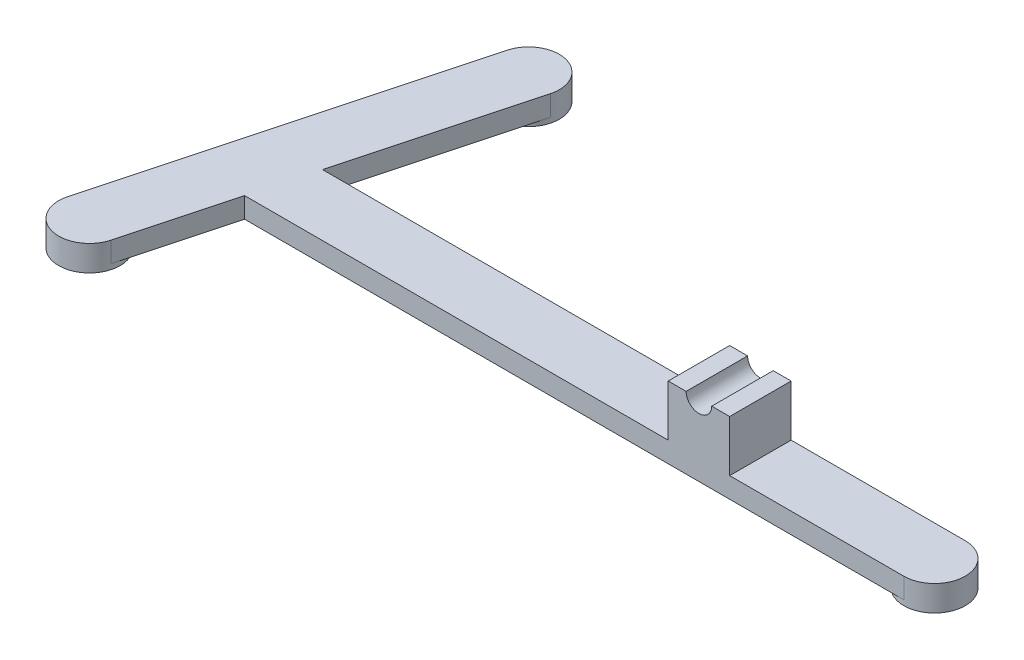
ISO-10303-21;
HEADER;
FILE_DESCRIPTION(('STEP AP214'),'2;1');
FILE_NAME('part.step','',(''),(''),'','','');
FILE_SCHEMA(('AUTOMOTIVE_DESIGN { 1 0 10303 214 1 1 1 1 }'));
ENDSEC;
DATA;
#1=APPLICATION_CONTEXT('core data for automotive mechanical design processes');
#2=APPLICATION_PROTOCOL_DEFINITION('international standard','automotive_design',2000,#1);
#3=PRODUCT_CONTEXT('',#1,'mechanical');
#4=PRODUCT('Part','Part','',(#3));
#5=PRODUCT_RELATED_PRODUCT_CATEGORY('part','',(#4));
#6=PRODUCT_DEFINITION_FORMATION('','',#4);
#7=PRODUCT_DEFINITION_CONTEXT('part definition',#1,'design');
#8=PRODUCT_DEFINITION('design','',#6,#7);
#9=PRODUCT_DEFINITION_SHAPE('','',#8);
#10=(LENGTH_UNIT() NAMED_UNIT(*) SI_UNIT(.MILLI.,.METRE.));
#11=(NAMED_UNIT(*) PLANE_ANGLE_UNIT() SI_UNIT($,.RADIAN.));
#12=(NAMED_UNIT(*) SI_UNIT($,.STERADIAN.) SOLID_ANGLE_UNIT());
#13=UNCERTAINTY_MEASURE_WITH_UNIT(LENGTH_MEASURE(1.E-05),#10,'distance_accuracy_value','');
#14=(GEOMETRIC_REPRESENTATION_CONTEXT(3) GLOBAL_UNCERTAINTY_ASSIGNED_CONTEXT((#13)) GLOBAL_UNIT_ASSIGNED_CONTEXT((#10,
#11,#12)) REPRESENTATION_CONTEXT('',''));
#15=CARTESIAN_POINT('',(0.,0.,0.));
#16=DIRECTION('',(0.,0.,1.));
#17=DIRECTION('',(1.,0.,0.));
#18=AXIS2_PLACEMENT_3D('',#15,#16,#17);
#19=CARTESIAN_POINT('',(0.,14.,0.));
#20=DIRECTION('',(0.,1.,0.));
#21=DIRECTION('',(0.,0.,1.));
#22=AXIS2_PLACEMENT_3D('',#19,#20,#21);
#23=PLANE('',#22);
#24=DIRECTION('',(0.,0.,1.));
#25=VECTOR('',#24,1.);
#26=CARTESIAN_POINT('',(96.6195321634862,14.,-17.4385911735114));
#27=LINE('',#26,#25);
#28=CARTESIAN_POINT('',(96.6195321634862,14.,-15.4385911735114));
#29=VERTEX_POINT('',#28);
#30=CARTESIAN_POINT('',(96.6195321634862,14.,-3.43859117351141));
#31=VERTEX_POINT('',#30);
#32=EDGE_CURVE('E11',#29,#31,#27,.T.);
#33=ORIENTED_EDGE('',*,*,#32,.F.);
#34=DIRECTION('',(1.,0.,0.));
#35=VECTOR('',#34,1.);
#36=CARTESIAN_POINT('',(0.,14.,-15.4385911735114));
#37=LINE('',#36,#35);
#38=CARTESIAN_POINT('',(93.1195321634862,14.,-15.4385911735114));
#39=VERTEX_POINT('',#38);
#40=EDGE_CURVE('E164',#39,#29,#37,.T.);
#41=ORIENTED_EDGE('',*,*,#40,.F.);
#42=DIRECTION('',(0.,0.,-1.));
#43=VECTOR('',#42,1.);
#44=CARTESIAN_POINT('',(93.1195321634862,14.,0.));
#45=LINE('',#44,#43);
#46=CARTESIAN_POINT('',(93.1195321634862,14.,-3.43859117351141));
#47=VERTEX_POINT('',#46);
#48=EDGE_CURVE('E154',#47,#39,#45,.T.);
#49=ORIENTED_EDGE('',*,*,#48,.F.);
#50=DIRECTION('',(1.,0.,0.));
#51=VECTOR('',#50,1.);
#52=CARTESIAN_POINT('',(0.,14.,-3.43859117351141));
#53=LINE('',#52,#51);
#54=EDGE_CURVE('E148',#47,#31,#53,.T.);
#55=ORIENTED_EDGE('',*,*,#54,.T.);
#56=EDGE_LOOP('',(#33,#41,#49,#55));
#57=FACE_BOUND('',#56,.T.);
#58=ADVANCED_FACE('F36',(#57),#23,.T.);
#59=CARTESIAN_POINT('',(0.,4.,-15.4385911735114));
#60=DIRECTION('',(0.,0.,-1.));
#61=DIRECTION('',(-1.,0.,0.));
#62=AXIS2_PLACEMENT_3D('',#59,#60,#61);
#63=PLANE('',#62);
#64=CARTESIAN_POINT('',(99.1195321634862,14.,-15.4385911735114));
#65=DIRECTION('',(0.,0.,-1.));
#66=DIRECTION('',(-1.,0.,0.));
#67=AXIS2_PLACEMENT_3D('',#64,#65,#66);
#68=CIRCLE('',#67,2.5);
#69=CARTESIAN_POINT('',(101.619532163486,14.,-15.4385911735114));
#70=VERTEX_POINT('',#69);
#71=EDGE_CURVE('E138',#70,#29,#68,.T.);
#72=ORIENTED_EDGE('',*,*,#71,.F.);
#73=CARTESIAN_POINT('',(105.119532163486,14.,-15.4385911735114));
#74=VERTEX_POINT('',#73);
#75=EDGE_CURVE('E158',#70,#74,#37,.T.);
#76=ORIENTED_EDGE('',*,*,#75,.T.);
#77=DIRECTION('',(0.,-1.,0.));
#78=VECTOR('',#77,1.);
#79=CARTESIAN_POINT('',(105.119532163486,14.,-15.4385911735114));
#80=LINE('',#79,#78);
#81=CARTESIAN_POINT('',(105.119532163486,4.,-15.4385911735114));
#82=VERTEX_POINT('',#81);
#83=EDGE_CURVE('E171',#74,#82,#80,.T.);
#84=ORIENTED_EDGE('',*,*,#83,.T.);
#85=DIRECTION('',(1.,0.,0.));
#86=VECTOR('',#85,1.);
#87=CARTESIAN_POINT('',(0.,4.,-15.4385911735114));
#88=LINE('',#87,#86);
#89=CARTESIAN_POINT('',(139.119532163486,4.,-15.4385911735114));
#90=VERTEX_POINT('',#89);
#91=EDGE_CURVE('E58',#82,#90,#88,.T.);
#92=ORIENTED_EDGE('',*,*,#91,.T.);
#93=DIRECTION('',(0.,-1.,0.));
#94=VECTOR('',#93,1.);
#95=CARTESIAN_POINT('',(139.119532163486,4.,-15.4385911735114));
#96=LINE('',#95,#94);
#97=CARTESIAN_POINT('',(139.119532163486,0.,-15.4385911735114));
#98=VERTEX_POINT('',#97);
#99=EDGE_CURVE('E160',#90,#98,#96,.T.);
#100=ORIENTED_EDGE('',*,*,#99,.T.);
#101=DIRECTION('',(1.,0.,0.));
#102=VECTOR('',#101,1.);
#103=CARTESIAN_POINT('',(0.,0.,-15.4385911735114));
#104=LINE('',#103,#102);
#105=CARTESIAN_POINT('',(13.6376142113114,0.,-15.4385911735114));
#106=VERTEX_POINT('',#105);
#107=EDGE_CURVE('E189',#106,#98,#104,.T.);
#108=ORIENTED_EDGE('',*,*,#107,.F.);
#109=DIRECTION('',(0.,-1.,0.));
#110=VECTOR('',#109,1.);
#111=CARTESIAN_POINT('',(13.6376142113114,4.,-15.4385911735114));
#112=LINE('',#111,#110);
#113=CARTESIAN_POINT('',(13.6376142113114,4.,-15.4385911735114));
#114=VERTEX_POINT('',#113);
#115=EDGE_CURVE('E237',#114,#106,#112,.T.);
#116=ORIENTED_EDGE('',*,*,#115,.F.);
#117=DIRECTION('',(1.,0.,0.));
#118=VECTOR('',#117,1.);
#119=CARTESIAN_POINT('',(0.,4.,-15.4385911735114));
#120=LINE('',#119,#118);
#121=CARTESIAN_POINT('',(93.1195321634862,4.,-15.4385911735114));
#122=VERTEX_POINT('',#121);
#123=EDGE_CURVE('E190',#114,#122,#120,.T.);
#124=ORIENTED_EDGE('',*,*,#123,.T.);
#125=DIRECTION('',(0.,-1.,0.));
#126=VECTOR('',#125,1.);
#127=CARTESIAN_POINT('',(93.1195321634862,14.,-15.4385911735114));
#128=LINE('',#127,#126);
#129=EDGE_CURVE('E169',#39,#122,#128,.T.);
#130=ORIENTED_EDGE('',*,*,#129,.F.);
#131=ORIENTED_EDGE('',*,*,#40,.T.);
#132=EDGE_LOOP('',(#72,#76,#84,#92,#100,#108,#116,#124,#130,#131));
#133=FACE_BOUND('',#132,.T.);
#134=ADVANCED_FACE('F38',(#133),#63,.T.);
#135=CARTESIAN_POINT('',(8.86441948928159,4.,2.37521404352368));
#136=DIRECTION('',(-0.965925826289069,0.,-0.258819045102518));
#137=DIRECTION('',(-0.258819045102518,0.,0.965925826289069));
#138=AXIS2_PLACEMENT_3D('',#135,#136,#137);
#139=PLANE('',#138);
#140=DIRECTION('',(0.258819045102518,0.,-0.965925826289069));
#141=VECTOR('',#140,1.);
#142=CARTESIAN_POINT('',(8.86441948928159,0.,2.37521404352368));
#143=LINE('',#142,#141);
#144=CARTESIAN_POINT('',(23.0324202783969,0.,-50.5004847431312));
#145=VERTEX_POINT('',#144);
#146=EDGE_CURVE('E210',#106,#145,#143,.T.);
#147=ORIENTED_EDGE('',*,*,#146,.T.);
#148=DIRECTION('',(0.,-1.,0.));
#149=VECTOR('',#148,1.);
#150=CARTESIAN_POINT('',(23.0324202783969,4.,-50.5004847431312));
#151=LINE('',#150,#149);
#152=CARTESIAN_POINT('',(23.0324202783969,4.,-50.5004847431312));
#153=VERTEX_POINT('',#152);
#154=EDGE_CURVE('E235',#153,#145,#151,.T.);
#155=ORIENTED_EDGE('',*,*,#154,.F.);
#156=DIRECTION('',(0.258819045102518,0.,-0.965925826289069));
#157=VECTOR('',#156,1.);
#158=CARTESIAN_POINT('',(8.86441948928159,4.,2.37521404352368));
#159=LINE('',#158,#157);
#160=EDGE_CURVE('E193',#114,#153,#159,.T.);
#161=ORIENTED_EDGE('',*,*,#160,.F.);
#162=ORIENTED_EDGE('',*,*,#115,.T.);
#163=EDGE_LOOP('',(#147,#155,#161,#162));
#164=FACE_BOUND('',#163,.T.);
#165=ADVANCED_FACE('F278',(#164),#139,.F.);
#166=CARTESIAN_POINT('',(-2.72669042618725,4.,-0.730614497706537));
#167=DIRECTION('',(-0.965925826289069,0.,-0.258819045102518));
#168=DIRECTION('',(-0.258819045102518,0.,0.965925826289069));
#169=AXIS2_PLACEMENT_3D('',#166,#167,#168);
#170=PLANE('',#169);
#171=DIRECTION('',(0.258819045102518,0.,-0.965925826289069));
#172=VECTOR('',#171,1.);
#173=CARTESIAN_POINT('',(-2.72669042618725,0.,-0.730614497706537));
#174=LINE('',#173,#172);
#175=CARTESIAN_POINT('',(-6.67602279424821,0.,14.0084945558735));
#176=VERTEX_POINT('',#175);
#177=CARTESIAN_POINT('',(11.441310362928,0.,-53.6063132843614));
#178=VERTEX_POINT('',#177);
#179=EDGE_CURVE('E216',#176,#178,#174,.T.);
#180=ORIENTED_EDGE('',*,*,#179,.F.);
#181=DIRECTION('',(0.,-1.,0.));
#182=VECTOR('',#181,1.);
#183=CARTESIAN_POINT('',(-6.67602279424821,4.,14.0084945558735));
#184=LINE('',#183,#182);
#185=CARTESIAN_POINT('',(-6.67602279424821,4.,14.0084945558735));
#186=VERTEX_POINT('',#185);
#187=EDGE_CURVE('E230',#186,#176,#184,.T.);
#188=ORIENTED_EDGE('',*,*,#187,.F.);
#189=DIRECTION('',(0.258819045102518,0.,-0.965925826289069));
#190=VECTOR('',#189,1.);
#191=CARTESIAN_POINT('',(-2.72669042618725,4.,-0.730614497706537));
#192=LINE('',#191,#190);
#193=CARTESIAN_POINT('',(11.441310362928,4.,-53.6063132843614));
#194=VERTEX_POINT('',#193);
#195=EDGE_CURVE('E197',#186,#194,#192,.T.);
#196=ORIENTED_EDGE('',*,*,#195,.T.);
#197=DIRECTION('',(0.,-1.,0.));
#198=VECTOR('',#197,1.);
#199=CARTESIAN_POINT('',(11.441310362928,4.,-53.6063132843614));
#200=LINE('',#199,#198);
#201=EDGE_CURVE('E232',#194,#178,#200,.T.);
#202=ORIENTED_EDGE('',*,*,#201,.T.);
#203=EDGE_LOOP('',(#180,#188,#196,#202));
#204=FACE_BOUND('',#203,.T.);
#205=ADVANCED_FACE('F294',(#204),#170,.T.);
#206=CARTESIAN_POINT('',(8.86441948928159,4.,2.37521404352368));
#207=DIRECTION('',(-0.965925826289069,0.,-0.258819045102518));
#208=DIRECTION('',(-0.258819045102518,0.,0.965925826289069));
#209=AXIS2_PLACEMENT_3D('',#206,#207,#208);
#210=PLANE('',#209);
#211=DIRECTION('',(0.258819045102518,0.,-0.965925826289069));
#212=VECTOR('',#211,1.);
#213=CARTESIAN_POINT('',(8.86441948928159,0.,2.37521404352368));
#214=LINE('',#213,#212);
#215=CARTESIAN_POINT('',(4.91508712122063,0.,17.1143230971037));
#216=VERTEX_POINT('',#215);
#217=CARTESIAN_POINT('',(10.422223902138,0.,-3.43859117351141));
#218=VERTEX_POINT('',#217);
#219=EDGE_CURVE('E222',#216,#218,#214,.T.);
#220=ORIENTED_EDGE('',*,*,#219,.T.);
#221=DIRECTION('',(0.,-1.,0.));
#222=VECTOR('',#221,1.);
#223=CARTESIAN_POINT('',(10.422223902138,4.,-3.43859117351141));
#224=LINE('',#223,#222);
#225=CARTESIAN_POINT('',(10.422223902138,4.,-3.43859117351141));
#226=VERTEX_POINT('',#225);
#227=EDGE_CURVE('E208',#226,#218,#224,.T.);
#228=ORIENTED_EDGE('',*,*,#227,.F.);
#229=DIRECTION('',(0.258819045102518,0.,-0.965925826289069));
#230=VECTOR('',#229,1.);
#231=CARTESIAN_POINT('',(8.86441948928159,4.,2.37521404352368));
#232=LINE('',#231,#230);
#233=CARTESIAN_POINT('',(4.91508712122062,4.,17.1143230971037));
#234=VERTEX_POINT('',#233);
#235=EDGE_CURVE('E200',#234,#226,#232,.T.);
#236=ORIENTED_EDGE('',*,*,#235,.F.);
#237=DIRECTION('',(0.,-1.,0.));
#238=VECTOR('',#237,1.);
#239=CARTESIAN_POINT('',(4.91508712122063,4.,17.1143230971037));
#240=LINE('',#239,#238);
#241=EDGE_CURVE('E227',#234,#216,#240,.T.);
#242=ORIENTED_EDGE('',*,*,#241,.T.);
#243=EDGE_LOOP('',(#220,#228,#236,#242));
#244=FACE_BOUND('',#243,.T.);
#245=ADVANCED_FACE('F287',(#244),#210,.F.);
#246=CARTESIAN_POINT('',(0.,4.,-3.43859117351141));
#247=DIRECTION('',(0.,0.,-1.));
#248=DIRECTION('',(-1.,0.,0.));
#249=AXIS2_PLACEMENT_3D('',#246,#247,#248);
#250=PLANE('',#249);
#251=CARTESIAN_POINT('',(101.619532163486,14.,-3.43859117351141));
#252=VERTEX_POINT('',#251);
#253=CARTESIAN_POINT('',(105.119532163486,14.,-3.43859117351141));
#254=VERTEX_POINT('',#253);
#255=EDGE_CURVE('E151',#252,#254,#53,.T.);
#256=ORIENTED_EDGE('',*,*,#255,.F.);
#257=CARTESIAN_POINT('',(99.1195321634862,14.,-3.43859117351141));
#258=DIRECTION('',(0.,0.,1.));
#259=DIRECTION('',(1.,0.,0.));
#260=AXIS2_PLACEMENT_3D('',#257,#258,#259);
#261=CIRCLE('',#260,2.5);
#262=EDGE_CURVE('E50',#31,#252,#261,.T.);
#263=ORIENTED_EDGE('',*,*,#262,.F.);
#264=ORIENTED_EDGE('',*,*,#54,.F.);
#265=DIRECTION('',(0.,-1.,0.));
#266=VECTOR('',#265,1.);
#267=CARTESIAN_POINT('',(93.1195321634862,14.,-3.43859117351141));
#268=LINE('',#267,#266);
#269=CARTESIAN_POINT('',(93.1195321634862,4.,-3.43859117351141));
#270=VERTEX_POINT('',#269);
#271=EDGE_CURVE('E167',#47,#270,#268,.T.);
#272=ORIENTED_EDGE('',*,*,#271,.T.);
#273=DIRECTION('',(1.,0.,0.));
#274=VECTOR('',#273,1.);
#275=CARTESIAN_POINT('',(0.,4.,-3.43859117351141));
#276=LINE('',#275,#274);
#277=EDGE_CURVE('E202',#226,#270,#276,.T.);
#278=ORIENTED_EDGE('',*,*,#277,.F.);
#279=ORIENTED_EDGE('',*,*,#227,.T.);
#280=DIRECTION('',(1.,0.,0.));
#281=VECTOR('',#280,1.);
#282=CARTESIAN_POINT('',(0.,0.,-3.43859117351141));
#283=LINE('',#282,#281);
#284=CARTESIAN_POINT('',(139.119532163486,0.,-3.43859117351141));
#285=VERTEX_POINT('',#284);
#286=EDGE_CURVE('E194',#218,#285,#283,.T.);
#287=ORIENTED_EDGE('',*,*,#286,.T.);
#288=DIRECTION('',(0.,-1.,0.));
#289=VECTOR('',#288,1.);
#290=CARTESIAN_POINT('',(139.119532163486,4.,-3.43859117351141));
#291=LINE('',#290,#289);
#292=CARTESIAN_POINT('',(139.119532163486,4.,-3.43859117351141));
#293=VERTEX_POINT('',#292);
#294=EDGE_CURVE('E262',#293,#285,#291,.T.);
#295=ORIENTED_EDGE('',*,*,#294,.F.);
#296=DIRECTION('',(1.,0.,0.));
#297=VECTOR('',#296,1.);
#298=CARTESIAN_POINT('',(0.,4.,-3.43859117351141));
#299=LINE('',#298,#297);
#300=CARTESIAN_POINT('',(105.119532163486,4.,-3.43859117351141));
#301=VERTEX_POINT('',#300);
#302=EDGE_CURVE('E253',#301,#293,#299,.T.);
#303=ORIENTED_EDGE('',*,*,#302,.F.);
#304=DIRECTION('',(0.,-1.,0.));
#305=VECTOR('',#304,1.);
#306=CARTESIAN_POINT('',(105.119532163486,14.,-3.43859117351141));
#307=LINE('',#306,#305);
#308=EDGE_CURVE('E174',#254,#301,#307,.T.);
#309=ORIENTED_EDGE('',*,*,#308,.F.);
#310=EDGE_LOOP('',(#256,#263,#264,#272,#278,#279,#287,#295,#303,#309));
#311=FACE_BOUND('',#310,.T.);
#312=ADVANCED_FACE('F146',(#311),#250,.F.);
#313=CARTESIAN_POINT('',(0.,4.,0.));
#314=DIRECTION('',(0.,1.,0.));
#315=DIRECTION('',(0.,0.,1.));
#316=AXIS2_PLACEMENT_3D('',#313,#314,#315);
#317=PLANE('',#316);
#318=ORIENTED_EDGE('',*,*,#123,.F.);
#319=ORIENTED_EDGE('',*,*,#160,.T.);
#320=CARTESIAN_POINT('',(17.2368653206625,4.,-52.0533990137463));
#321=DIRECTION('',(0.,1.,0.));
#322=DIRECTION('',(0.,0.,1.));
#323=AXIS2_PLACEMENT_3D('',#320,#321,#322);
#324=CIRCLE('',#323,6.);
#325=EDGE_CURVE('E177',#153,#194,#324,.T.);
#326=ORIENTED_EDGE('',*,*,#325,.T.);
#327=ORIENTED_EDGE('',*,*,#195,.F.);
#328=CARTESIAN_POINT('',(-0.880467836513796,4.,15.5614088264886));
#329=DIRECTION('',(0.,1.,0.));
#330=DIRECTION('',(0.,0.,1.));
#331=AXIS2_PLACEMENT_3D('',#328,#329,#330);
#332=CIRCLE('',#331,6.);
#333=EDGE_CURVE('E183',#186,#234,#332,.T.);
#334=ORIENTED_EDGE('',*,*,#333,.T.);
#335=ORIENTED_EDGE('',*,*,#235,.T.);
#336=ORIENTED_EDGE('',*,*,#277,.T.);
#337=DIRECTION('',(0.,0.,-1.));
#338=VECTOR('',#337,1.);
#339=CARTESIAN_POINT('',(93.1195321634862,4.,0.));
#340=LINE('',#339,#338);
#341=EDGE_CURVE('E205',#270,#122,#340,.T.);
#342=ORIENTED_EDGE('',*,*,#341,.T.);
#343=EDGE_LOOP('',(#318,#319,#326,#327,#334,#335,#336,#342));
#344=FACE_BOUND('',#343,.T.);
#345=ADVANCED_FACE('F280',(#344),#317,.T.);
#346=CARTESIAN_POINT('',(0.,0.,0.));
#347=DIRECTION('',(0.,1.,0.));
#348=DIRECTION('',(0.,0.,1.));
#349=AXIS2_PLACEMENT_3D('',#346,#347,#348);
#350=PLANE('',#349);
#351=ORIENTED_EDGE('',*,*,#107,.T.);
#352=CARTESIAN_POINT('',(139.119532163486,0.,-9.43859117351141));
#353=DIRECTION('',(0.,1.,0.));
#354=DIRECTION('',(0.,0.,1.));
#355=AXIS2_PLACEMENT_3D('',#352,#353,#354);
#356=CIRCLE('',#355,6.00000000000002);
#357=EDGE_CURVE('E251',#98,#285,#356,.T.);
#358=ORIENTED_EDGE('',*,*,#357,.T.);
#359=ORIENTED_EDGE('',*,*,#286,.F.);
#360=ORIENTED_EDGE('',*,*,#219,.F.);
#361=CARTESIAN_POINT('',(-0.880467836513796,0.,15.5614088264886));
#362=DIRECTION('',(0.,1.,0.));
#363=DIRECTION('',(0.,0.,1.));
#364=AXIS2_PLACEMENT_3D('',#361,#362,#363);
#365=CIRCLE('',#364,6.);
#366=EDGE_CURVE('E219',#216,#176,#365,.T.);
#367=ORIENTED_EDGE('',*,*,#366,.T.);
#368=ORIENTED_EDGE('',*,*,#179,.T.);
#369=CARTESIAN_POINT('',(17.2368653206625,0.,-52.0533990137463));
#370=DIRECTION('',(0.,1.,0.));
#371=DIRECTION('',(0.,0.,1.));
#372=AXIS2_PLACEMENT_3D('',#369,#370,#371);
#373=CIRCLE('',#372,6.);
#374=EDGE_CURVE('E213',#178,#145,#373,.T.);
#375=ORIENTED_EDGE('',*,*,#374,.T.);
#376=ORIENTED_EDGE('',*,*,#146,.F.);
#377=EDGE_LOOP('',(#351,#358,#359,#360,#367,#368,#375,#376));
#378=FACE_BOUND('',#377,.T.);
#379=ADVANCED_FACE('F271',(#378),#350,.F.);
#380=CARTESIAN_POINT('',(-0.880467836513796,-1.,15.5614088264886));
#381=DIRECTION('',(0.,1.,0.));
#382=DIRECTION('',(0.,0.,1.));
#383=AXIS2_PLACEMENT_3D('',#380,#381,#382);
#384=CYLINDRICAL_SURFACE('',#383,6.);
#385=CARTESIAN_POINT('',(-0.880467836513796,-1.,15.5614088264886));
#386=DIRECTION('',(0.,1.,0.));
#387=DIRECTION('',(0.,0.,1.));
#388=AXIS2_PLACEMENT_3D('',#385,#386,#387);
#389=CIRCLE('',#388,6.);
#390=CARTESIAN_POINT('',(-0.880467836513796,-1.,21.5614088264886));
#391=VERTEX_POINT('',#390);
#392=EDGE_CURVE('E186',#391,#391,#389,.T.);
#393=ORIENTED_EDGE('',*,*,#392,.T.);
#394=EDGE_LOOP('',(#393));
#395=FACE_BOUND('',#394,.T.);
#396=ORIENTED_EDGE('',*,*,#187,.T.);
#397=ORIENTED_EDGE('',*,*,#366,.F.);
#398=ORIENTED_EDGE('',*,*,#241,.F.);
#399=ORIENTED_EDGE('',*,*,#333,.F.);
#400=EDGE_LOOP('',(#396,#397,#398,#399));
#401=FACE_BOUND('',#400,.T.);
#402=ADVANCED_FACE('F290',(#395,#401),#384,.T.);
#403=CARTESIAN_POINT('',(0.,-1.,0.));
#404=DIRECTION('',(0.,1.,0.));
#405=DIRECTION('',(0.,0.,1.));
#406=AXIS2_PLACEMENT_3D('',#403,#404,#405);
#407=PLANE('',#406);
#408=ORIENTED_EDGE('',*,*,#392,.F.);
#409=EDGE_LOOP('',(#408));
#410=FACE_BOUND('',#409,.T.);
#411=ADVANCED_FACE('F299',(#410),#407,.F.);
#412=CARTESIAN_POINT('',(17.2368653206625,-1.,-52.0533990137463));
#413=DIRECTION('',(0.,1.,0.));
#414=DIRECTION('',(0.,0.,1.));
#415=AXIS2_PLACEMENT_3D('',#412,#413,#414);
#416=CYLINDRICAL_SURFACE('',#415,6.);
#417=CARTESIAN_POINT('',(17.2368653206625,-1.,-52.0533990137463));
#418=DIRECTION('',(0.,1.,0.));
#419=DIRECTION('',(0.,0.,1.));
#420=AXIS2_PLACEMENT_3D('',#417,#418,#419);
#421=CIRCLE('',#420,6.);
#422=CARTESIAN_POINT('',(17.2368653206625,-1.,-46.0533990137463));
#423=VERTEX_POINT('',#422);
#424=EDGE_CURVE('E180',#423,#423,#421,.T.);
#425=ORIENTED_EDGE('',*,*,#424,.T.);
#426=EDGE_LOOP('',(#425));
#427=FACE_BOUND('',#426,.T.);
#428=ORIENTED_EDGE('',*,*,#154,.T.);
#429=ORIENTED_EDGE('',*,*,#374,.F.);
#430=ORIENTED_EDGE('',*,*,#201,.F.);
#431=ORIENTED_EDGE('',*,*,#325,.F.);
#432=EDGE_LOOP('',(#428,#429,#430,#431));
#433=FACE_BOUND('',#432,.T.);
#434=ADVANCED_FACE('F296',(#427,#433),#416,.T.);
#435=CARTESIAN_POINT('',(0.,-1.,0.));
#436=DIRECTION('',(0.,1.,0.));
#437=DIRECTION('',(0.,0.,1.));
#438=AXIS2_PLACEMENT_3D('',#435,#436,#437);
#439=PLANE('',#438);
#440=ORIENTED_EDGE('',*,*,#424,.F.);
#441=EDGE_LOOP('',(#440));
#442=FACE_BOUND('',#441,.T.);
#443=ADVANCED_FACE('F298',(#442),#439,.F.);
#444=CARTESIAN_POINT('',(93.1195321634862,14.,0.));
#445=DIRECTION('',(-1.,0.,0.));
#446=DIRECTION('',(0.,0.,1.));
#447=AXIS2_PLACEMENT_3D('',#444,#445,#446);
#448=PLANE('',#447);
#449=ORIENTED_EDGE('',*,*,#341,.F.);
#450=ORIENTED_EDGE('',*,*,#271,.F.);
#451=ORIENTED_EDGE('',*,*,#48,.T.);
#452=ORIENTED_EDGE('',*,*,#129,.T.);
#453=EDGE_LOOP('',(#449,#450,#451,#452));
#454=FACE_BOUND('',#453,.T.);
#455=ADVANCED_FACE('F283',(#454),#448,.T.);
#456=CARTESIAN_POINT('',(105.119532163486,14.,0.));
#457=DIRECTION('',(-1.,0.,0.));
#458=DIRECTION('',(0.,0.,1.));
#459=AXIS2_PLACEMENT_3D('',#456,#457,#458);
#460=PLANE('',#459);
#461=ORIENTED_EDGE('',*,*,#308,.T.);
#462=DIRECTION('',(0.,0.,-1.));
#463=VECTOR('',#462,1.);
#464=CARTESIAN_POINT('',(105.119532163486,4.,0.));
#465=LINE('',#464,#463);
#466=EDGE_CURVE('E248',#301,#82,#465,.T.);
#467=ORIENTED_EDGE('',*,*,#466,.T.);
#468=ORIENTED_EDGE('',*,*,#83,.F.);
#469=DIRECTION('',(0.,0.,-1.));
#470=VECTOR('',#469,1.);
#471=CARTESIAN_POINT('',(105.119532163486,14.,0.));
#472=LINE('',#471,#470);
#473=EDGE_CURVE('E155',#254,#74,#472,.T.);
#474=ORIENTED_EDGE('',*,*,#473,.F.);
#475=EDGE_LOOP('',(#461,#467,#468,#474));
#476=FACE_BOUND('',#475,.T.);
#477=ADVANCED_FACE('F247',(#476),#460,.F.);
#478=DIRECTION('',(0.,0.,1.));
#479=VECTOR('',#478,1.);
#480=CARTESIAN_POINT('',(101.619532163486,14.,-17.4385911735114));
#481=LINE('',#480,#479);
#482=EDGE_CURVE('E44',#252,#70,#481,.F.);
#483=ORIENTED_EDGE('',*,*,#482,.F.);
#484=ORIENTED_EDGE('',*,*,#255,.T.);
#485=ORIENTED_EDGE('',*,*,#473,.T.);
#486=ORIENTED_EDGE('',*,*,#75,.F.);
#487=EDGE_LOOP('',(#483,#484,#485,#486));
#488=FACE_BOUND('',#487,.T.);
#489=ADVANCED_FACE('F243',(#488),#23,.T.);
#490=CARTESIAN_POINT('',(0.,4.,0.));
#491=DIRECTION('',(0.,1.,0.));
#492=DIRECTION('',(0.,0.,1.));
#493=AXIS2_PLACEMENT_3D('',#490,#491,#492);
#494=PLANE('',#493);
#495=ORIENTED_EDGE('',*,*,#302,.T.);
#496=CARTESIAN_POINT('',(139.119532163486,4.,-9.43859117351141));
#497=DIRECTION('',(0.,1.,0.));
#498=DIRECTION('',(0.,0.,1.));
#499=AXIS2_PLACEMENT_3D('',#496,#497,#498);
#500=CIRCLE('',#499,6.);
#501=EDGE_CURVE('E241',#293,#90,#500,.T.);
#502=ORIENTED_EDGE('',*,*,#501,.T.);
#503=ORIENTED_EDGE('',*,*,#91,.F.);
#504=ORIENTED_EDGE('',*,*,#466,.F.);
#505=EDGE_LOOP('',(#495,#502,#503,#504));
#506=FACE_BOUND('',#505,.T.);
#507=ADVANCED_FACE('F318',(#506),#494,.T.);
#508=CARTESIAN_POINT('',(139.119532163486,-1.,-9.43859117351141));
#509=DIRECTION('',(0.,1.,0.));
#510=DIRECTION('',(0.,0.,1.));
#511=AXIS2_PLACEMENT_3D('',#508,#509,#510);
#512=CYLINDRICAL_SURFACE('',#511,6.);
#513=ORIENTED_EDGE('',*,*,#357,.F.);
#514=ORIENTED_EDGE('',*,*,#99,.F.);
#515=ORIENTED_EDGE('',*,*,#501,.F.);
#516=ORIENTED_EDGE('',*,*,#294,.T.);
#517=EDGE_LOOP('',(#513,#514,#515,#516));
#518=FACE_BOUND('',#517,.T.);
#519=CARTESIAN_POINT('',(139.119532163486,-1.,-9.43859117351141));
#520=DIRECTION('',(0.,1.,0.));
#521=DIRECTION('',(0.,0.,1.));
#522=AXIS2_PLACEMENT_3D('',#519,#520,#521);
#523=CIRCLE('',#522,6.);
#524=CARTESIAN_POINT('',(139.119532163486,-1.,-3.43859117351141));
#525=VERTEX_POINT('',#524);
#526=EDGE_CURVE('E256',#525,#525,#523,.T.);
#527=ORIENTED_EDGE('',*,*,#526,.T.);
#528=EDGE_LOOP('',(#527));
#529=FACE_BOUND('',#528,.T.);
#530=ADVANCED_FACE('F267',(#518,#529),#512,.T.);
#531=CARTESIAN_POINT('',(0.,-1.,0.));
#532=DIRECTION('',(0.,1.,0.));
#533=DIRECTION('',(0.,0.,1.));
#534=AXIS2_PLACEMENT_3D('',#531,#532,#533);
#535=PLANE('',#534);
#536=ORIENTED_EDGE('',*,*,#526,.F.);
#537=EDGE_LOOP('',(#536));
#538=FACE_BOUND('',#537,.T.);
#539=ADVANCED_FACE('F434',(#538),#535,.F.);
#540=CARTESIAN_POINT('',(99.1195321634862,14.,-17.4385911735114));
#541=DIRECTION('',(0.,0.,1.));
#542=DIRECTION('',(1.,0.,0.));
#543=AXIS2_PLACEMENT_3D('',#540,#541,#542);
#544=CYLINDRICAL_SURFACE('',#543,2.5);
#545=ORIENTED_EDGE('',*,*,#32,.T.);
#546=ORIENTED_EDGE('',*,*,#262,.T.);
#547=ORIENTED_EDGE('',*,*,#482,.T.);
#548=ORIENTED_EDGE('',*,*,#71,.T.);
#549=EDGE_LOOP('',(#545,#546,#547,#548));
#550=FACE_BOUND('',#549,.T.);
#551=ADVANCED_FACE('F136',(#550),#544,.F.);
#552=CLOSED_SHELL('',(#58,#134,#165,#205,#245,#312,#345,#379,#402,#411,#434,#443,#455,#477,#489,
#507,#530,#539,#551));
#553=MANIFOLD_SOLID_BREP('B2',#552);
#554=ADVANCED_BREP_SHAPE_REPRESENTATION('',(#18,#553),#14);
#555=SHAPE_DEFINITION_REPRESENTATION(#9,#554);
ENDSEC;
END-ISO-10303-21;
